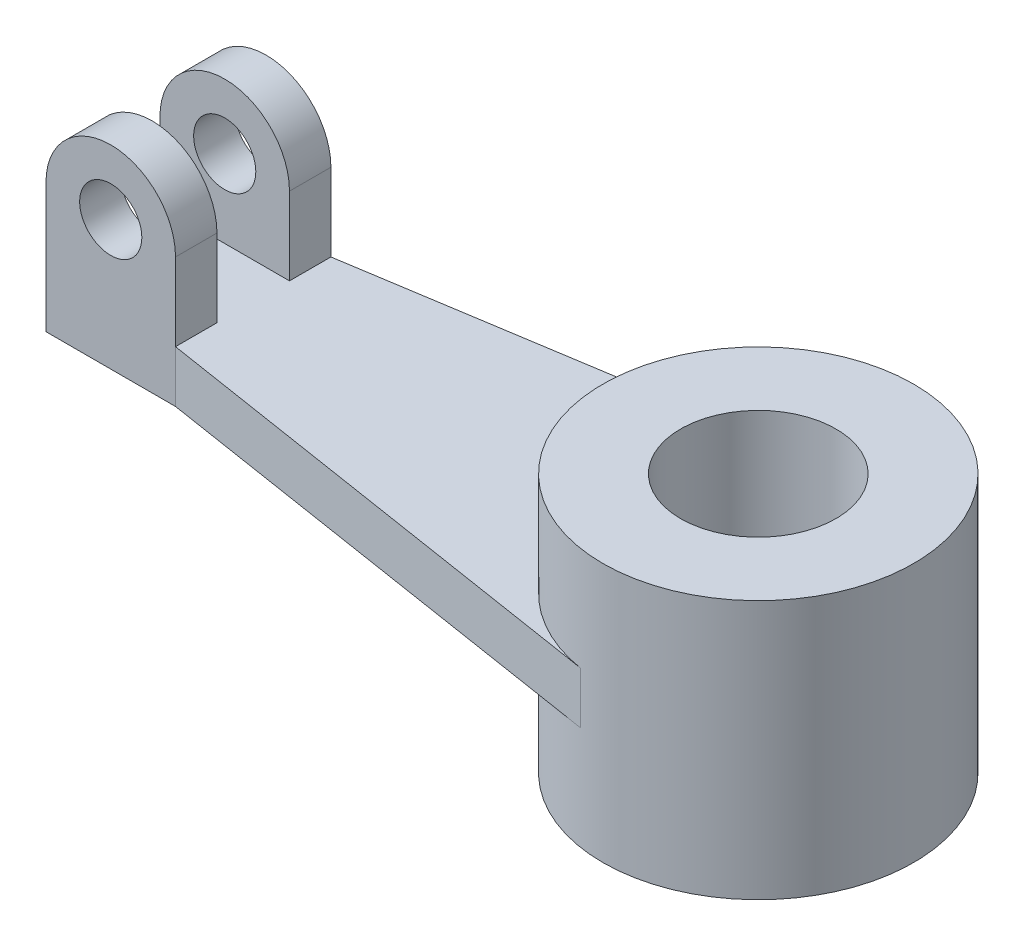
ISO-10303-21;
HEADER;
FILE_DESCRIPTION(('STEP AP214'),'2;1');
FILE_NAME('part.step','',(''),(''),'','','');
FILE_SCHEMA(('AUTOMOTIVE_DESIGN { 1 0 10303 214 1 1 1 1 }'));
ENDSEC;
DATA;
#1=APPLICATION_CONTEXT('core data for automotive mechanical design processes');
#2=APPLICATION_PROTOCOL_DEFINITION('international standard','automotive_design',2000,#1);
#3=PRODUCT_CONTEXT('',#1,'mechanical');
#4=PRODUCT('Part','Part','',(#3));
#5=PRODUCT_RELATED_PRODUCT_CATEGORY('part','',(#4));
#6=PRODUCT_DEFINITION_FORMATION('','',#4);
#7=PRODUCT_DEFINITION_CONTEXT('part definition',#1,'design');
#8=PRODUCT_DEFINITION('design','',#6,#7);
#9=PRODUCT_DEFINITION_SHAPE('','',#8);
#10=(LENGTH_UNIT() NAMED_UNIT(*) SI_UNIT(.MILLI.,.METRE.));
#11=(NAMED_UNIT(*) PLANE_ANGLE_UNIT() SI_UNIT($,.RADIAN.));
#12=(NAMED_UNIT(*) SI_UNIT($,.STERADIAN.) SOLID_ANGLE_UNIT());
#13=UNCERTAINTY_MEASURE_WITH_UNIT(LENGTH_MEASURE(1.E-05),#10,'distance_accuracy_value','');
#14=(GEOMETRIC_REPRESENTATION_CONTEXT(3) GLOBAL_UNCERTAINTY_ASSIGNED_CONTEXT((#13)) GLOBAL_UNIT_ASSIGNED_CONTEXT((#10,
#11,#12)) REPRESENTATION_CONTEXT('',''));
#15=CARTESIAN_POINT('',(0.,0.,0.));
#16=DIRECTION('',(0.,0.,1.));
#17=DIRECTION('',(1.,0.,0.));
#18=AXIS2_PLACEMENT_3D('',#15,#16,#17);
#19=CARTESIAN_POINT('',(-110.,20.,-15.));
#20=DIRECTION('',(0.,0.,-1.));
#21=DIRECTION('',(-1.,0.,0.));
#22=AXIS2_PLACEMENT_3D('',#19,#20,#21);
#23=CYLINDRICAL_SURFACE('',#22,12.5);
#24=DIRECTION('',(0.,0.,1.));
#25=VECTOR('',#24,1.);
#26=CARTESIAN_POINT('',(-97.5,20.,-15.));
#27=LINE('',#26,#25);
#28=CARTESIAN_POINT('',(-97.5,20.,-15.));
#29=VERTEX_POINT('',#28);
#30=CARTESIAN_POINT('',(-97.5,20.,-7.));
#31=VERTEX_POINT('',#30);
#32=EDGE_CURVE('E217',#29,#31,#27,.T.);
#33=ORIENTED_EDGE('',*,*,#32,.F.);
#34=CARTESIAN_POINT('',(-110.,20.,-15.));
#35=DIRECTION('',(0.,0.,1.));
#36=DIRECTION('',(1.,0.,0.));
#37=AXIS2_PLACEMENT_3D('',#34,#35,#36);
#38=CIRCLE('',#37,12.5);
#39=CARTESIAN_POINT('',(-122.5,20.,-15.));
#40=VERTEX_POINT('',#39);
#41=EDGE_CURVE('E44',#40,#29,#38,.F.);
#42=ORIENTED_EDGE('',*,*,#41,.F.);
#43=DIRECTION('',(0.,0.,1.));
#44=VECTOR('',#43,1.);
#45=CARTESIAN_POINT('',(-122.5,20.,-15.));
#46=LINE('',#45,#44);
#47=CARTESIAN_POINT('',(-122.5,20.,-7.));
#48=VERTEX_POINT('',#47);
#49=EDGE_CURVE('E220',#48,#40,#46,.F.);
#50=ORIENTED_EDGE('',*,*,#49,.F.);
#51=CARTESIAN_POINT('',(-110.,20.,-7.));
#52=DIRECTION('',(0.,0.,-1.));
#53=DIRECTION('',(-1.,0.,0.));
#54=AXIS2_PLACEMENT_3D('',#51,#52,#53);
#55=CIRCLE('',#54,12.5);
#56=EDGE_CURVE('E11',#31,#48,#55,.F.);
#57=ORIENTED_EDGE('',*,*,#56,.F.);
#58=EDGE_LOOP('',(#33,#42,#50,#57));
#59=FACE_BOUND('',#58,.T.);
#60=ADVANCED_FACE('F35',(#59),#23,.T.);
#61=CARTESIAN_POINT('',(-110.,20.,7.));
#62=DIRECTION('',(0.,0.,-1.));
#63=DIRECTION('',(-1.,0.,0.));
#64=AXIS2_PLACEMENT_3D('',#61,#62,#63);
#65=CYLINDRICAL_SURFACE('',#64,12.5);
#66=DIRECTION('',(0.,0.,-1.));
#67=VECTOR('',#66,1.);
#68=CARTESIAN_POINT('',(-97.5,20.,15.));
#69=LINE('',#68,#67);
#70=CARTESIAN_POINT('',(-97.5,20.,7.));
#71=VERTEX_POINT('',#70);
#72=CARTESIAN_POINT('',(-97.5,20.,15.));
#73=VERTEX_POINT('',#72);
#74=EDGE_CURVE('E206',#71,#73,#69,.F.);
#75=ORIENTED_EDGE('',*,*,#74,.F.);
#76=CARTESIAN_POINT('',(-110.,20.,7.));
#77=DIRECTION('',(0.,0.,1.));
#78=DIRECTION('',(1.,0.,0.));
#79=AXIS2_PLACEMENT_3D('',#76,#77,#78);
#80=CIRCLE('',#79,12.5);
#81=CARTESIAN_POINT('',(-122.5,20.,7.));
#82=VERTEX_POINT('',#81);
#83=EDGE_CURVE('E213',#82,#71,#80,.F.);
#84=ORIENTED_EDGE('',*,*,#83,.F.);
#85=DIRECTION('',(0.,0.,-1.));
#86=VECTOR('',#85,1.);
#87=CARTESIAN_POINT('',(-122.5,20.,-15.));
#88=LINE('',#87,#86);
#89=CARTESIAN_POINT('',(-122.5,20.,15.));
#90=VERTEX_POINT('',#89);
#91=EDGE_CURVE('E211',#90,#82,#88,.T.);
#92=ORIENTED_EDGE('',*,*,#91,.F.);
#93=CARTESIAN_POINT('',(-110.,20.,15.));
#94=DIRECTION('',(0.,0.,-1.));
#95=DIRECTION('',(-1.,0.,0.));
#96=AXIS2_PLACEMENT_3D('',#93,#94,#95);
#97=CIRCLE('',#96,12.5);
#98=EDGE_CURVE('E215',#73,#90,#97,.F.);
#99=ORIENTED_EDGE('',*,*,#98,.F.);
#100=EDGE_LOOP('',(#75,#84,#92,#99));
#101=FACE_BOUND('',#100,.T.);
#102=ADVANCED_FACE('F242',(#101),#65,.T.);
#103=CARTESIAN_POINT('',(0.,5.,0.));
#104=DIRECTION('',(0.,1.,0.));
#105=DIRECTION('',(0.,0.,1.));
#106=AXIS2_PLACEMENT_3D('',#103,#104,#105);
#107=PLANE('',#106);
#108=DIRECTION('',(0.,0.,-1.));
#109=VECTOR('',#108,1.);
#110=CARTESIAN_POINT('',(-97.5,5.,-15.));
#111=LINE('',#110,#109);
#112=CARTESIAN_POINT('',(-97.5,5.,-7.));
#113=VERTEX_POINT('',#112);
#114=CARTESIAN_POINT('',(-97.5,5.,-15.));
#115=VERTEX_POINT('',#114);
#116=EDGE_CURVE('E140',#113,#115,#111,.T.);
#117=ORIENTED_EDGE('',*,*,#116,.F.);
#118=DIRECTION('',(1.,0.,0.));
#119=VECTOR('',#118,1.);
#120=CARTESIAN_POINT('',(-122.5,5.,-7.));
#121=LINE('',#120,#119);
#122=CARTESIAN_POINT('',(-122.5,5.,-7.));
#123=VERTEX_POINT('',#122);
#124=EDGE_CURVE('E119',#123,#113,#121,.T.);
#125=ORIENTED_EDGE('',*,*,#124,.F.);
#126=DIRECTION('',(0.,0.,1.));
#127=VECTOR('',#126,1.);
#128=CARTESIAN_POINT('',(-122.5,5.,-15.));
#129=LINE('',#128,#127);
#130=CARTESIAN_POINT('',(-122.5,5.,7.));
#131=VERTEX_POINT('',#130);
#132=EDGE_CURVE('E125',#123,#131,#129,.T.);
#133=ORIENTED_EDGE('',*,*,#132,.T.);
#134=DIRECTION('',(-1.,0.,0.));
#135=VECTOR('',#134,1.);
#136=CARTESIAN_POINT('',(-122.5,5.,7.));
#137=LINE('',#136,#135);
#138=CARTESIAN_POINT('',(-97.5,5.,7.));
#139=VERTEX_POINT('',#138);
#140=EDGE_CURVE('E153',#139,#131,#137,.T.);
#141=ORIENTED_EDGE('',*,*,#140,.F.);
#142=DIRECTION('',(0.,0.,-1.));
#143=VECTOR('',#142,1.);
#144=CARTESIAN_POINT('',(-97.5,5.,15.));
#145=LINE('',#144,#143);
#146=CARTESIAN_POINT('',(-97.5,5.,15.));
#147=VERTEX_POINT('',#146);
#148=EDGE_CURVE('E121',#147,#139,#145,.T.);
#149=ORIENTED_EDGE('',*,*,#148,.F.);
#150=DIRECTION('',(0.987800769478854,0.,0.155722958541715));
#151=VECTOR('',#150,1.);
#152=CARTESIAN_POINT('',(-97.5,5.,15.));
#153=LINE('',#152,#151);
#154=CARTESIAN_POINT('',(-4.67168875625144,5.,29.6340230843656));
#155=VERTEX_POINT('',#154);
#156=EDGE_CURVE('E133',#147,#155,#153,.T.);
#157=ORIENTED_EDGE('',*,*,#156,.T.);
#158=CARTESIAN_POINT('',(0.,5.,0.));
#159=DIRECTION('',(0.,-1.,0.));
#160=DIRECTION('',(0.,0.,1.));
#161=AXIS2_PLACEMENT_3D('',#158,#159,#160);
#162=CIRCLE('',#161,30.);
#163=CARTESIAN_POINT('',(-4.67168875625144,5.,-29.6340230843656));
#164=VERTEX_POINT('',#163);
#165=EDGE_CURVE('E163',#155,#164,#162,.T.);
#166=ORIENTED_EDGE('',*,*,#165,.T.);
#167=DIRECTION('',(-0.987800769478854,0.,0.155722958541715));
#168=VECTOR('',#167,1.);
#169=CARTESIAN_POINT('',(-97.5,5.,-15.));
#170=LINE('',#169,#168);
#171=EDGE_CURVE('E166',#164,#115,#170,.T.);
#172=ORIENTED_EDGE('',*,*,#171,.T.);
#173=EDGE_LOOP('',(#117,#125,#133,#141,#149,#157,#166,#172));
#174=FACE_BOUND('',#173,.T.);
#175=ADVANCED_FACE('F137',(#174),#107,.T.);
#176=CARTESIAN_POINT('',(0.,25.,0.));
#177=DIRECTION('',(0.,1.,0.));
#178=DIRECTION('',(0.,0.,1.));
#179=AXIS2_PLACEMENT_3D('',#176,#177,#178);
#180=PLANE('',#179);
#181=CARTESIAN_POINT('',(0.,25.,0.));
#182=DIRECTION('',(0.,1.,0.));
#183=DIRECTION('',(0.,0.,1.));
#184=AXIS2_PLACEMENT_3D('',#181,#182,#183);
#185=CIRCLE('',#184,30.);
#186=CARTESIAN_POINT('',(0.,25.,30.));
#187=VERTEX_POINT('',#186);
#188=EDGE_CURVE('E203',#187,#187,#185,.T.);
#189=ORIENTED_EDGE('',*,*,#188,.T.);
#190=EDGE_LOOP('',(#189));
#191=FACE_BOUND('',#190,.T.);
#192=CARTESIAN_POINT('',(0.,25.,0.));
#193=DIRECTION('',(0.,1.,0.));
#194=DIRECTION('',(0.,0.,1.));
#195=AXIS2_PLACEMENT_3D('',#192,#193,#194);
#196=CIRCLE('',#195,15.);
#197=CARTESIAN_POINT('',(0.,25.,15.));
#198=VERTEX_POINT('',#197);
#199=EDGE_CURVE('E197',#198,#198,#196,.T.);
#200=ORIENTED_EDGE('',*,*,#199,.F.);
#201=EDGE_LOOP('',(#200));
#202=FACE_BOUND('',#201,.T.);
#203=ADVANCED_FACE('F250',(#191,#202),#180,.T.);
#204=CARTESIAN_POINT('',(0.,-25.,0.));
#205=DIRECTION('',(0.,1.,0.));
#206=DIRECTION('',(0.,0.,1.));
#207=AXIS2_PLACEMENT_3D('',#204,#205,#206);
#208=PLANE('',#207);
#209=CARTESIAN_POINT('',(0.,-25.,0.));
#210=DIRECTION('',(0.,1.,0.));
#211=DIRECTION('',(0.,0.,1.));
#212=AXIS2_PLACEMENT_3D('',#209,#210,#211);
#213=CIRCLE('',#212,30.);
#214=CARTESIAN_POINT('',(0.,-25.,30.));
#215=VERTEX_POINT('',#214);
#216=EDGE_CURVE('E200',#215,#215,#213,.T.);
#217=ORIENTED_EDGE('',*,*,#216,.F.);
#218=EDGE_LOOP('',(#217));
#219=FACE_BOUND('',#218,.T.);
#220=CARTESIAN_POINT('',(0.,-25.,0.));
#221=DIRECTION('',(0.,1.,0.));
#222=DIRECTION('',(0.,0.,1.));
#223=AXIS2_PLACEMENT_3D('',#220,#221,#222);
#224=CIRCLE('',#223,15.);
#225=CARTESIAN_POINT('',(0.,-25.,15.));
#226=VERTEX_POINT('',#225);
#227=EDGE_CURVE('E196',#226,#226,#224,.T.);
#228=ORIENTED_EDGE('',*,*,#227,.T.);
#229=EDGE_LOOP('',(#228));
#230=FACE_BOUND('',#229,.T.);
#231=ADVANCED_FACE('F261',(#219,#230),#208,.F.);
#232=CARTESIAN_POINT('',(0.,25.,0.));
#233=DIRECTION('',(0.,-1.,0.));
#234=DIRECTION('',(0.,0.,-1.));
#235=AXIS2_PLACEMENT_3D('',#232,#233,#234);
#236=CYLINDRICAL_SURFACE('',#235,30.);
#237=DIRECTION('',(0.,-1.,0.));
#238=VECTOR('',#237,1.);
#239=CARTESIAN_POINT('',(-4.67168875625144,5.,-29.6340230843656));
#240=LINE('',#239,#238);
#241=CARTESIAN_POINT('',(-4.67168875625144,-5.,-29.6340230843656));
#242=VERTEX_POINT('',#241);
#243=EDGE_CURVE('E184',#164,#242,#240,.T.);
#244=ORIENTED_EDGE('',*,*,#243,.F.);
#245=ORIENTED_EDGE('',*,*,#165,.F.);
#246=DIRECTION('',(0.,-1.,0.));
#247=VECTOR('',#246,1.);
#248=CARTESIAN_POINT('',(-4.67168875625144,5.,29.6340230843656));
#249=LINE('',#248,#247);
#250=CARTESIAN_POINT('',(-4.67168875625144,-5.,29.6340230843656));
#251=VERTEX_POINT('',#250);
#252=EDGE_CURVE('E187',#155,#251,#249,.T.);
#253=ORIENTED_EDGE('',*,*,#252,.T.);
#254=CARTESIAN_POINT('',(0.,-5.,0.));
#255=DIRECTION('',(0.,-1.,0.));
#256=DIRECTION('',(0.,0.,1.));
#257=AXIS2_PLACEMENT_3D('',#254,#255,#256);
#258=CIRCLE('',#257,30.);
#259=EDGE_CURVE('E179',#251,#242,#258,.T.);
#260=ORIENTED_EDGE('',*,*,#259,.T.);
#261=EDGE_LOOP('',(#244,#245,#253,#260));
#262=FACE_BOUND('',#261,.T.);
#263=ORIENTED_EDGE('',*,*,#188,.F.);
#264=EDGE_LOOP('',(#263));
#265=FACE_BOUND('',#264,.T.);
#266=ORIENTED_EDGE('',*,*,#216,.T.);
#267=EDGE_LOOP('',(#266));
#268=FACE_BOUND('',#267,.T.);
#269=ADVANCED_FACE('F257',(#262,#265,#268),#236,.T.);
#270=CARTESIAN_POINT('',(0.,25.,0.));
#271=DIRECTION('',(0.,-1.,0.));
#272=DIRECTION('',(0.,0.,-1.));
#273=AXIS2_PLACEMENT_3D('',#270,#271,#272);
#274=CYLINDRICAL_SURFACE('',#273,15.);
#275=ORIENTED_EDGE('',*,*,#199,.T.);
#276=EDGE_LOOP('',(#275));
#277=FACE_BOUND('',#276,.T.);
#278=ORIENTED_EDGE('',*,*,#227,.F.);
#279=EDGE_LOOP('',(#278));
#280=FACE_BOUND('',#279,.T.);
#281=ADVANCED_FACE('F260',(#277,#280),#274,.F.);
#282=CARTESIAN_POINT('',(-122.5,5.,-15.));
#283=DIRECTION('',(0.,0.,1.));
#284=DIRECTION('',(1.,0.,0.));
#285=AXIS2_PLACEMENT_3D('',#282,#283,#284);
#286=PLANE('',#285);
#287=CARTESIAN_POINT('',(-110.,20.,-15.));
#288=DIRECTION('',(0.,0.,1.));
#289=DIRECTION('',(1.,0.,0.));
#290=AXIS2_PLACEMENT_3D('',#287,#288,#289);
#291=CIRCLE('',#290,6.);
#292=CARTESIAN_POINT('',(-104.,20.,-15.));
#293=VERTEX_POINT('',#292);
#294=EDGE_CURVE('E337',#293,#293,#291,.F.);
#295=ORIENTED_EDGE('',*,*,#294,.F.);
#296=EDGE_LOOP('',(#295));
#297=FACE_BOUND('',#296,.T.);
#298=DIRECTION('',(0.,-1.,0.));
#299=VECTOR('',#298,1.);
#300=CARTESIAN_POINT('',(-122.5,5.,-15.));
#301=LINE('',#300,#299);
#302=CARTESIAN_POINT('',(-122.5,-5.,-15.));
#303=VERTEX_POINT('',#302);
#304=EDGE_CURVE('E194',#40,#303,#301,.T.);
#305=ORIENTED_EDGE('',*,*,#304,.F.);
#306=ORIENTED_EDGE('',*,*,#41,.T.);
#307=DIRECTION('',(0.,-1.,0.));
#308=VECTOR('',#307,1.);
#309=CARTESIAN_POINT('',(-97.5,32.5,-15.));
#310=LINE('',#309,#308);
#311=EDGE_CURVE('E143',#29,#115,#310,.T.);
#312=ORIENTED_EDGE('',*,*,#311,.T.);
#313=DIRECTION('',(0.,-1.,0.));
#314=VECTOR('',#313,1.);
#315=CARTESIAN_POINT('',(-97.5,5.,-15.));
#316=LINE('',#315,#314);
#317=CARTESIAN_POINT('',(-97.5,-5.,-15.));
#318=VERTEX_POINT('',#317);
#319=EDGE_CURVE('E168',#115,#318,#316,.T.);
#320=ORIENTED_EDGE('',*,*,#319,.T.);
#321=DIRECTION('',(-1.,0.,0.));
#322=VECTOR('',#321,1.);
#323=CARTESIAN_POINT('',(-122.5,-5.,-15.));
#324=LINE('',#323,#322);
#325=EDGE_CURVE('E159',#318,#303,#324,.T.);
#326=ORIENTED_EDGE('',*,*,#325,.T.);
#327=EDGE_LOOP('',(#305,#306,#312,#320,#326));
#328=FACE_BOUND('',#327,.T.);
#329=ADVANCED_FACE('F224',(#297,#328),#286,.F.);
#330=CARTESIAN_POINT('',(-122.5,5.,-15.));
#331=DIRECTION('',(1.,0.,0.));
#332=DIRECTION('',(0.,0.,-1.));
#333=AXIS2_PLACEMENT_3D('',#330,#331,#332);
#334=PLANE('',#333);
#335=DIRECTION('',(0.,-1.,0.));
#336=VECTOR('',#335,1.);
#337=CARTESIAN_POINT('',(-122.5,32.5,-7.));
#338=LINE('',#337,#336);
#339=EDGE_CURVE('E115',#48,#123,#338,.T.);
#340=ORIENTED_EDGE('',*,*,#339,.F.);
#341=ORIENTED_EDGE('',*,*,#49,.T.);
#342=ORIENTED_EDGE('',*,*,#304,.T.);
#343=DIRECTION('',(0.,0.,1.));
#344=VECTOR('',#343,1.);
#345=CARTESIAN_POINT('',(-122.5,-5.,-15.));
#346=LINE('',#345,#344);
#347=CARTESIAN_POINT('',(-122.5,-5.,15.));
#348=VERTEX_POINT('',#347);
#349=EDGE_CURVE('E171',#303,#348,#346,.T.);
#350=ORIENTED_EDGE('',*,*,#349,.T.);
#351=DIRECTION('',(0.,-1.,0.));
#352=VECTOR('',#351,1.);
#353=CARTESIAN_POINT('',(-122.5,5.,15.));
#354=LINE('',#353,#352);
#355=EDGE_CURVE('E192',#90,#348,#354,.T.);
#356=ORIENTED_EDGE('',*,*,#355,.F.);
#357=ORIENTED_EDGE('',*,*,#91,.T.);
#358=DIRECTION('',(0.,-1.,0.));
#359=VECTOR('',#358,1.);
#360=CARTESIAN_POINT('',(-122.5,32.5,7.));
#361=LINE('',#360,#359);
#362=EDGE_CURVE('E129',#82,#131,#361,.T.);
#363=ORIENTED_EDGE('',*,*,#362,.T.);
#364=ORIENTED_EDGE('',*,*,#132,.F.);
#365=EDGE_LOOP('',(#340,#341,#342,#350,#356,#357,#363,#364));
#366=FACE_BOUND('',#365,.T.);
#367=ADVANCED_FACE('F126',(#366),#334,.F.);
#368=CARTESIAN_POINT('',(-122.5,5.,15.));
#369=DIRECTION('',(0.,0.,-1.));
#370=DIRECTION('',(-1.,0.,0.));
#371=AXIS2_PLACEMENT_3D('',#368,#369,#370);
#372=PLANE('',#371);
#373=CARTESIAN_POINT('',(-110.,20.,15.));
#374=DIRECTION('',(0.,0.,1.));
#375=DIRECTION('',(1.,0.,0.));
#376=AXIS2_PLACEMENT_3D('',#373,#374,#375);
#377=CIRCLE('',#376,6.);
#378=CARTESIAN_POINT('',(-104.,20.,15.));
#379=VERTEX_POINT('',#378);
#380=EDGE_CURVE('E336',#379,#379,#377,.T.);
#381=ORIENTED_EDGE('',*,*,#380,.F.);
#382=EDGE_LOOP('',(#381));
#383=FACE_BOUND('',#382,.T.);
#384=DIRECTION('',(0.,-1.,0.));
#385=VECTOR('',#384,1.);
#386=CARTESIAN_POINT('',(-97.5,32.5,15.));
#387=LINE('',#386,#385);
#388=EDGE_CURVE('E158',#73,#147,#387,.T.);
#389=ORIENTED_EDGE('',*,*,#388,.F.);
#390=ORIENTED_EDGE('',*,*,#98,.T.);
#391=ORIENTED_EDGE('',*,*,#355,.T.);
#392=DIRECTION('',(1.,0.,0.));
#393=VECTOR('',#392,1.);
#394=CARTESIAN_POINT('',(-122.5,-5.,15.));
#395=LINE('',#394,#393);
#396=CARTESIAN_POINT('',(-97.5,-5.,15.));
#397=VERTEX_POINT('',#396);
#398=EDGE_CURVE('E174',#348,#397,#395,.T.);
#399=ORIENTED_EDGE('',*,*,#398,.T.);
#400=DIRECTION('',(0.,-1.,0.));
#401=VECTOR('',#400,1.);
#402=CARTESIAN_POINT('',(-97.5,5.,15.));
#403=LINE('',#402,#401);
#404=EDGE_CURVE('E189',#147,#397,#403,.T.);
#405=ORIENTED_EDGE('',*,*,#404,.F.);
#406=EDGE_LOOP('',(#389,#390,#391,#399,#405));
#407=FACE_BOUND('',#406,.T.);
#408=ADVANCED_FACE('F277',(#383,#407),#372,.F.);
#409=CARTESIAN_POINT('',(-97.5,5.,15.));
#410=DIRECTION('',(0.155722958541715,0.,-0.987800769478854));
#411=DIRECTION('',(-0.987800769478854,0.,-0.155722958541715));
#412=AXIS2_PLACEMENT_3D('',#409,#410,#411);
#413=PLANE('',#412);
#414=DIRECTION('',(0.987800769478854,0.,0.155722958541715));
#415=VECTOR('',#414,1.);
#416=CARTESIAN_POINT('',(-97.5,-5.,15.));
#417=LINE('',#416,#415);
#418=EDGE_CURVE('E176',#397,#251,#417,.T.);
#419=ORIENTED_EDGE('',*,*,#418,.T.);
#420=ORIENTED_EDGE('',*,*,#252,.F.);
#421=ORIENTED_EDGE('',*,*,#156,.F.);
#422=ORIENTED_EDGE('',*,*,#404,.T.);
#423=EDGE_LOOP('',(#419,#420,#421,#422));
#424=FACE_BOUND('',#423,.T.);
#425=ADVANCED_FACE('F280',(#424),#413,.F.);
#426=CARTESIAN_POINT('',(-97.5,5.,-15.));
#427=DIRECTION('',(0.155722958541715,0.,0.987800769478854));
#428=DIRECTION('',(0.987800769478854,0.,-0.155722958541715));
#429=AXIS2_PLACEMENT_3D('',#426,#427,#428);
#430=PLANE('',#429);
#431=DIRECTION('',(-0.987800769478854,0.,0.155722958541715));
#432=VECTOR('',#431,1.);
#433=CARTESIAN_POINT('',(-97.5,-5.,-15.));
#434=LINE('',#433,#432);
#435=EDGE_CURVE('E134',#242,#318,#434,.T.);
#436=ORIENTED_EDGE('',*,*,#435,.T.);
#437=ORIENTED_EDGE('',*,*,#319,.F.);
#438=ORIENTED_EDGE('',*,*,#171,.F.);
#439=ORIENTED_EDGE('',*,*,#243,.T.);
#440=EDGE_LOOP('',(#436,#437,#438,#439));
#441=FACE_BOUND('',#440,.T.);
#442=ADVANCED_FACE('F284',(#441),#430,.F.);
#443=CARTESIAN_POINT('',(0.,-5.,0.));
#444=DIRECTION('',(0.,1.,0.));
#445=DIRECTION('',(0.,0.,1.));
#446=AXIS2_PLACEMENT_3D('',#443,#444,#445);
#447=PLANE('',#446);
#448=ORIENTED_EDGE('',*,*,#325,.F.);
#449=ORIENTED_EDGE('',*,*,#435,.F.);
#450=ORIENTED_EDGE('',*,*,#259,.F.);
#451=ORIENTED_EDGE('',*,*,#418,.F.);
#452=ORIENTED_EDGE('',*,*,#398,.F.);
#453=ORIENTED_EDGE('',*,*,#349,.F.);
#454=EDGE_LOOP('',(#448,#449,#450,#451,#452,#453));
#455=FACE_BOUND('',#454,.T.);
#456=ADVANCED_FACE('F288',(#455),#447,.F.);
#457=CARTESIAN_POINT('',(-97.5,32.5,15.));
#458=DIRECTION('',(-1.,0.,0.));
#459=DIRECTION('',(0.,0.,1.));
#460=AXIS2_PLACEMENT_3D('',#457,#458,#459);
#461=PLANE('',#460);
#462=DIRECTION('',(0.,-1.,0.));
#463=VECTOR('',#462,1.);
#464=CARTESIAN_POINT('',(-97.5,32.5,7.));
#465=LINE('',#464,#463);
#466=EDGE_CURVE('E156',#71,#139,#465,.T.);
#467=ORIENTED_EDGE('',*,*,#466,.F.);
#468=ORIENTED_EDGE('',*,*,#74,.T.);
#469=ORIENTED_EDGE('',*,*,#388,.T.);
#470=ORIENTED_EDGE('',*,*,#148,.T.);
#471=EDGE_LOOP('',(#467,#468,#469,#470));
#472=FACE_BOUND('',#471,.T.);
#473=ADVANCED_FACE('F291',(#472),#461,.F.);
#474=CARTESIAN_POINT('',(-122.5,32.5,7.));
#475=DIRECTION('',(0.,0.,1.));
#476=DIRECTION('',(1.,0.,0.));
#477=AXIS2_PLACEMENT_3D('',#474,#475,#476);
#478=PLANE('',#477);
#479=CARTESIAN_POINT('',(-110.,20.,7.00000000000001));
#480=DIRECTION('',(0.,0.,1.));
#481=DIRECTION('',(1.,0.,0.));
#482=AXIS2_PLACEMENT_3D('',#479,#480,#481);
#483=CIRCLE('',#482,6.);
#484=CARTESIAN_POINT('',(-104.,20.,7.00000000000001));
#485=VERTEX_POINT('',#484);
#486=EDGE_CURVE('E141',#485,#485,#483,.T.);
#487=ORIENTED_EDGE('',*,*,#486,.T.);
#488=EDGE_LOOP('',(#487));
#489=FACE_BOUND('',#488,.T.);
#490=ORIENTED_EDGE('',*,*,#362,.F.);
#491=ORIENTED_EDGE('',*,*,#83,.T.);
#492=ORIENTED_EDGE('',*,*,#466,.T.);
#493=ORIENTED_EDGE('',*,*,#140,.T.);
#494=EDGE_LOOP('',(#490,#491,#492,#493));
#495=FACE_BOUND('',#494,.T.);
#496=ADVANCED_FACE('F238',(#489,#495),#478,.F.);
#497=CARTESIAN_POINT('',(-122.5,32.5,-7.));
#498=DIRECTION('',(0.,0.,-1.));
#499=DIRECTION('',(-1.,0.,0.));
#500=AXIS2_PLACEMENT_3D('',#497,#498,#499);
#501=PLANE('',#500);
#502=CARTESIAN_POINT('',(-110.,20.,-7.));
#503=DIRECTION('',(0.,0.,-1.));
#504=DIRECTION('',(-1.,0.,0.));
#505=AXIS2_PLACEMENT_3D('',#502,#503,#504);
#506=CIRCLE('',#505,6.);
#507=CARTESIAN_POINT('',(-116.,20.,-7.));
#508=VERTEX_POINT('',#507);
#509=EDGE_CURVE('E39',#508,#508,#506,.T.);
#510=ORIENTED_EDGE('',*,*,#509,.T.);
#511=EDGE_LOOP('',(#510));
#512=FACE_BOUND('',#511,.T.);
#513=DIRECTION('',(0.,-1.,0.));
#514=VECTOR('',#513,1.);
#515=CARTESIAN_POINT('',(-97.5,32.5,-7.));
#516=LINE('',#515,#514);
#517=EDGE_CURVE('E122',#31,#113,#516,.T.);
#518=ORIENTED_EDGE('',*,*,#517,.F.);
#519=ORIENTED_EDGE('',*,*,#56,.T.);
#520=ORIENTED_EDGE('',*,*,#339,.T.);
#521=ORIENTED_EDGE('',*,*,#124,.T.);
#522=EDGE_LOOP('',(#518,#519,#520,#521));
#523=FACE_BOUND('',#522,.T.);
#524=ADVANCED_FACE('F117',(#512,#523),#501,.F.);
#525=CARTESIAN_POINT('',(-97.5,32.5,-15.));
#526=DIRECTION('',(-1.,0.,0.));
#527=DIRECTION('',(0.,0.,1.));
#528=AXIS2_PLACEMENT_3D('',#525,#526,#527);
#529=PLANE('',#528);
#530=ORIENTED_EDGE('',*,*,#311,.F.);
#531=ORIENTED_EDGE('',*,*,#32,.T.);
#532=ORIENTED_EDGE('',*,*,#517,.T.);
#533=ORIENTED_EDGE('',*,*,#116,.T.);
#534=EDGE_LOOP('',(#530,#531,#532,#533));
#535=FACE_BOUND('',#534,.T.);
#536=ADVANCED_FACE('F227',(#535),#529,.F.);
#537=CARTESIAN_POINT('',(-110.,20.,-31.9705627484771));
#538=DIRECTION('',(0.,0.,1.));
#539=DIRECTION('',(1.,0.,0.));
#540=AXIS2_PLACEMENT_3D('',#537,#538,#539);
#541=CYLINDRICAL_SURFACE('',#540,6.);
#542=ORIENTED_EDGE('',*,*,#294,.T.);
#543=EDGE_LOOP('',(#542));
#544=FACE_BOUND('',#543,.T.);
#545=ORIENTED_EDGE('',*,*,#509,.F.);
#546=EDGE_LOOP('',(#545));
#547=FACE_BOUND('',#546,.T.);
#548=ADVANCED_FACE('F229',(#544,#547),#541,.F.);
#549=ORIENTED_EDGE('',*,*,#380,.T.);
#550=EDGE_LOOP('',(#549));
#551=FACE_BOUND('',#550,.T.);
#552=ORIENTED_EDGE('',*,*,#486,.F.);
#553=EDGE_LOOP('',(#552));
#554=FACE_BOUND('',#553,.T.);
#555=ADVANCED_FACE('F235',(#551,#554),#541,.F.);
#556=CLOSED_SHELL('',(#60,#102,#175,#203,#231,#269,#281,#329,#367,#408,#425,#442,#456,#473,#496,
#524,#536,#548,#555));
#557=MANIFOLD_SOLID_BREP('B2',#556);
#558=ADVANCED_BREP_SHAPE_REPRESENTATION('',(#18,#557),#14);
#559=SHAPE_DEFINITION_REPRESENTATION(#9,#558);
ENDSEC;
END-ISO-10303-21;
